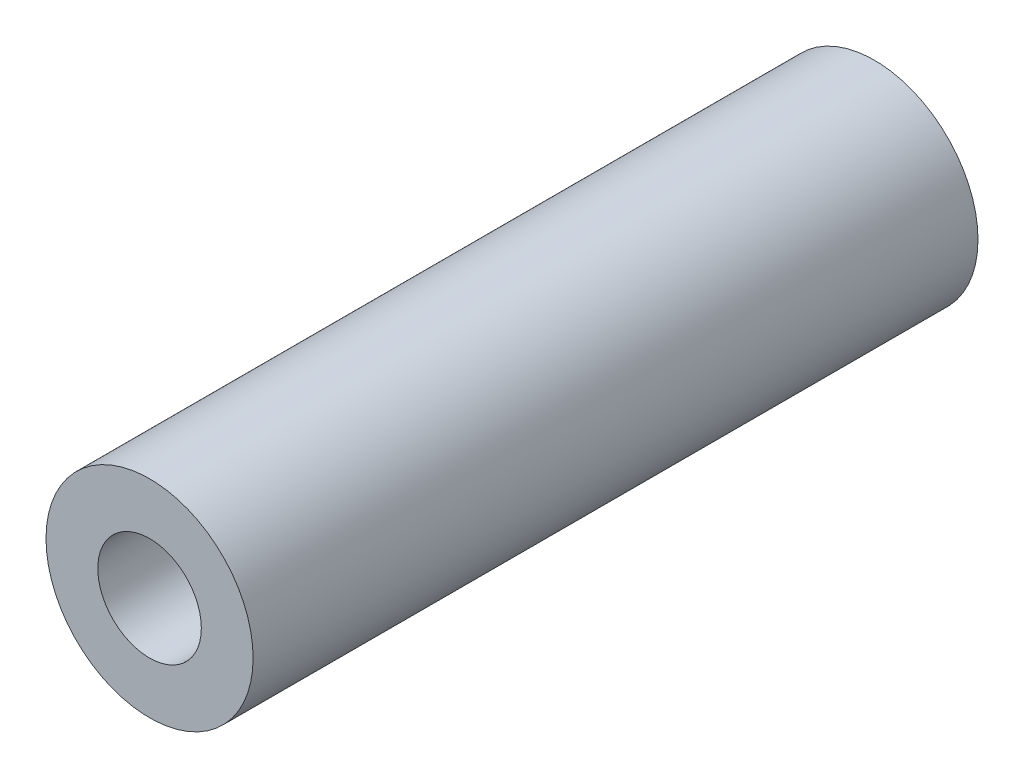
ISO-10303-21;
HEADER;
FILE_DESCRIPTION(('STEP AP214'),'2;1');
FILE_NAME('part.step','',(''),(''),'','','');
FILE_SCHEMA(('AUTOMOTIVE_DESIGN { 1 0 10303 214 1 1 1 1 }'));
ENDSEC;
DATA;
#1=APPLICATION_CONTEXT('core data for automotive mechanical design processes');
#2=APPLICATION_PROTOCOL_DEFINITION('international standard','automotive_design',2000,#1);
#3=PRODUCT_CONTEXT('',#1,'mechanical');
#4=PRODUCT('Part','Part','',(#3));
#5=PRODUCT_RELATED_PRODUCT_CATEGORY('part','',(#4));
#6=PRODUCT_DEFINITION_FORMATION('','',#4);
#7=PRODUCT_DEFINITION_CONTEXT('part definition',#1,'design');
#8=PRODUCT_DEFINITION('design','',#6,#7);
#9=PRODUCT_DEFINITION_SHAPE('','',#8);
#10=(LENGTH_UNIT() NAMED_UNIT(*) SI_UNIT(.MILLI.,.METRE.));
#11=(NAMED_UNIT(*) PLANE_ANGLE_UNIT() SI_UNIT($,.RADIAN.));
#12=(NAMED_UNIT(*) SI_UNIT($,.STERADIAN.) SOLID_ANGLE_UNIT());
#13=UNCERTAINTY_MEASURE_WITH_UNIT(LENGTH_MEASURE(1.E-05),#10,'distance_accuracy_value','');
#14=(GEOMETRIC_REPRESENTATION_CONTEXT(3) GLOBAL_UNCERTAINTY_ASSIGNED_CONTEXT((#13)) GLOBAL_UNIT_ASSIGNED_CONTEXT((#10,
#11,#12)) REPRESENTATION_CONTEXT('',''));
#15=CARTESIAN_POINT('',(0.,0.,0.));
#16=DIRECTION('',(0.,0.,1.));
#17=DIRECTION('',(1.,0.,0.));
#18=AXIS2_PLACEMENT_3D('',#15,#16,#17);
#19=CARTESIAN_POINT('',(0.,0.,77.));
#20=DIRECTION('',(0.,0.,1.));
#21=DIRECTION('',(1.,0.,0.));
#22=AXIS2_PLACEMENT_3D('',#19,#20,#21);
#23=PLANE('',#22);
#24=CARTESIAN_POINT('',(0.,0.,77.));
#25=DIRECTION('',(0.,0.,1.));
#26=DIRECTION('',(1.,0.,0.));
#27=AXIS2_PLACEMENT_3D('',#24,#25,#26);
#28=CIRCLE('',#27,11.);
#29=CARTESIAN_POINT('',(11.,0.,77.));
#30=VERTEX_POINT('',#29);
#31=EDGE_CURVE('E10',#30,#30,#28,.T.);
#32=ORIENTED_EDGE('',*,*,#31,.T.);
#33=EDGE_LOOP('',(#32));
#34=FACE_BOUND('',#33,.T.);
#35=CARTESIAN_POINT('',(0.,0.,77.));
#36=DIRECTION('',(0.,0.,1.));
#37=DIRECTION('',(1.,0.,0.));
#38=AXIS2_PLACEMENT_3D('',#35,#36,#37);
#39=CIRCLE('',#38,5.5);
#40=CARTESIAN_POINT('',(5.5,0.,77.));
#41=VERTEX_POINT('',#40);
#42=EDGE_CURVE('E54',#41,#41,#39,.T.);
#43=ORIENTED_EDGE('',*,*,#42,.F.);
#44=EDGE_LOOP('',(#43));
#45=FACE_BOUND('',#44,.T.);
#46=ADVANCED_FACE('F41',(#34,#45),#23,.T.);
#47=CARTESIAN_POINT('',(0.,0.,0.));
#48=DIRECTION('',(0.,0.,1.));
#49=DIRECTION('',(1.,0.,0.));
#50=AXIS2_PLACEMENT_3D('',#47,#48,#49);
#51=PLANE('',#50);
#52=CARTESIAN_POINT('',(0.,0.,0.));
#53=DIRECTION('',(0.,0.,1.));
#54=DIRECTION('',(1.,0.,0.));
#55=AXIS2_PLACEMENT_3D('',#52,#53,#54);
#56=CIRCLE('',#55,11.);
#57=CARTESIAN_POINT('',(11.,0.,0.));
#58=VERTEX_POINT('',#57);
#59=EDGE_CURVE('E45',#58,#58,#56,.T.);
#60=ORIENTED_EDGE('',*,*,#59,.F.);
#61=EDGE_LOOP('',(#60));
#62=FACE_BOUND('',#61,.T.);
#63=CARTESIAN_POINT('',(0.,0.,0.));
#64=DIRECTION('',(0.,0.,1.));
#65=DIRECTION('',(1.,0.,0.));
#66=AXIS2_PLACEMENT_3D('',#63,#64,#65);
#67=CIRCLE('',#66,5.5);
#68=CARTESIAN_POINT('',(5.5,0.,0.));
#69=VERTEX_POINT('',#68);
#70=EDGE_CURVE('E56',#69,#69,#67,.T.);
#71=ORIENTED_EDGE('',*,*,#70,.T.);
#72=EDGE_LOOP('',(#71));
#73=FACE_BOUND('',#72,.T.);
#74=ADVANCED_FACE('F68',(#62,#73),#51,.F.);
#75=CARTESIAN_POINT('',(0.,0.,77.));
#76=DIRECTION('',(0.,0.,-1.));
#77=DIRECTION('',(-1.,0.,0.));
#78=AXIS2_PLACEMENT_3D('',#75,#76,#77);
#79=CYLINDRICAL_SURFACE('',#78,11.);
#80=ORIENTED_EDGE('',*,*,#31,.F.);
#81=EDGE_LOOP('',(#80));
#82=FACE_BOUND('',#81,.T.);
#83=ORIENTED_EDGE('',*,*,#59,.T.);
#84=EDGE_LOOP('',(#83));
#85=FACE_BOUND('',#84,.T.);
#86=ADVANCED_FACE('F43',(#82,#85),#79,.T.);
#87=CARTESIAN_POINT('',(0.,0.,77.));
#88=DIRECTION('',(0.,0.,-1.));
#89=DIRECTION('',(-1.,0.,0.));
#90=AXIS2_PLACEMENT_3D('',#87,#88,#89);
#91=CYLINDRICAL_SURFACE('',#90,5.5);
#92=ORIENTED_EDGE('',*,*,#42,.T.);
#93=EDGE_LOOP('',(#92));
#94=FACE_BOUND('',#93,.T.);
#95=ORIENTED_EDGE('',*,*,#70,.F.);
#96=EDGE_LOOP('',(#95));
#97=FACE_BOUND('',#96,.T.);
#98=ADVANCED_FACE('F64',(#94,#97),#91,.F.);
#99=CLOSED_SHELL('',(#46,#74,#86,#98));
#100=MANIFOLD_SOLID_BREP('B2',#99);
#101=ADVANCED_BREP_SHAPE_REPRESENTATION('',(#18,#100),#14);
#102=SHAPE_DEFINITION_REPRESENTATION(#9,#101);
ENDSEC;
END-ISO-10303-21;
